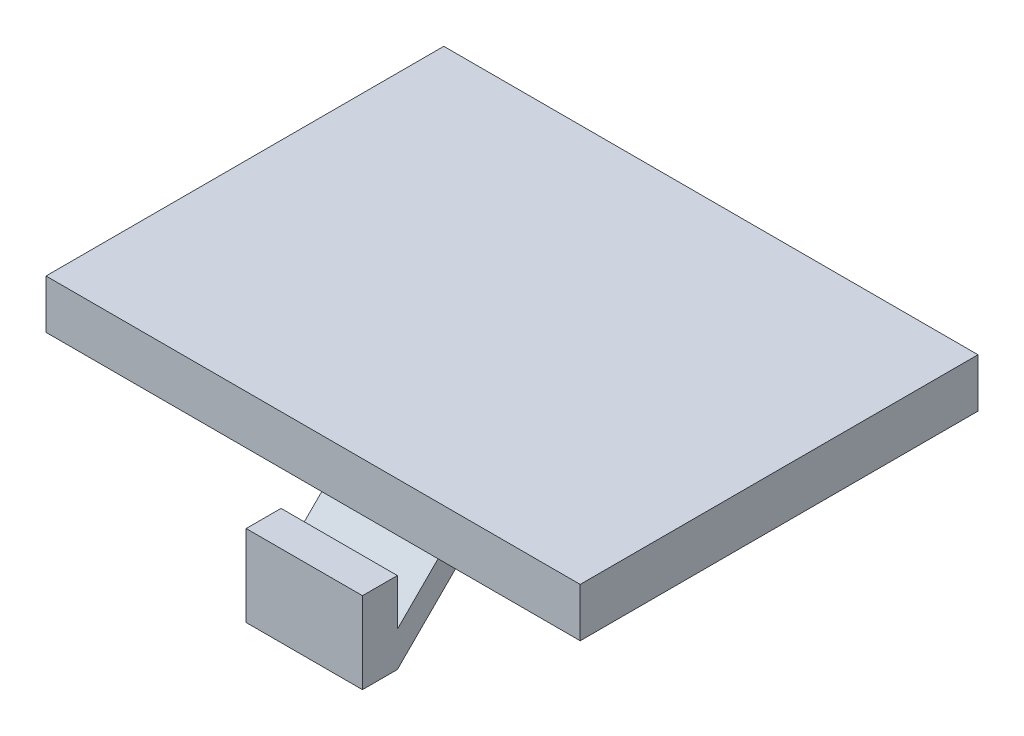
ISO-10303-21;
HEADER;
FILE_DESCRIPTION(('STEP AP214'),'2;1');
FILE_NAME('part.step','',(''),(''),'','','');
FILE_SCHEMA(('AUTOMOTIVE_DESIGN { 1 0 10303 214 1 1 1 1 }'));
ENDSEC;
DATA;
#1=APPLICATION_CONTEXT('core data for automotive mechanical design processes');
#2=APPLICATION_PROTOCOL_DEFINITION('international standard','automotive_design',2000,#1);
#3=PRODUCT_CONTEXT('',#1,'mechanical');
#4=PRODUCT('Part','Part','',(#3));
#5=PRODUCT_RELATED_PRODUCT_CATEGORY('part','',(#4));
#6=PRODUCT_DEFINITION_FORMATION('','',#4);
#7=PRODUCT_DEFINITION_CONTEXT('part definition',#1,'design');
#8=PRODUCT_DEFINITION('design','',#6,#7);
#9=PRODUCT_DEFINITION_SHAPE('','',#8);
#10=(LENGTH_UNIT() NAMED_UNIT(*) SI_UNIT(.MILLI.,.METRE.));
#11=(NAMED_UNIT(*) PLANE_ANGLE_UNIT() SI_UNIT($,.RADIAN.));
#12=(NAMED_UNIT(*) SI_UNIT($,.STERADIAN.) SOLID_ANGLE_UNIT());
#13=UNCERTAINTY_MEASURE_WITH_UNIT(LENGTH_MEASURE(1.E-05),#10,'distance_accuracy_value','');
#14=(GEOMETRIC_REPRESENTATION_CONTEXT(3) GLOBAL_UNCERTAINTY_ASSIGNED_CONTEXT((#13)) GLOBAL_UNIT_ASSIGNED_CONTEXT((#10,
#11,#12)) REPRESENTATION_CONTEXT('',''));
#15=CARTESIAN_POINT('',(0.,0.,0.));
#16=DIRECTION('',(0.,0.,1.));
#17=DIRECTION('',(1.,0.,0.));
#18=AXIS2_PLACEMENT_3D('',#15,#16,#17);
#19=CARTESIAN_POINT('',(-89.5,-291557.1,18.100000000004));
#20=DIRECTION('',(0.,0.,1.));
#21=DIRECTION('',(1.,0.,0.));
#22=AXIS2_PLACEMENT_3D('',#19,#20,#21);
#23=PLANE('',#22);
#24=DIRECTION('',(-1.,0.,0.));
#25=VECTOR('',#24,1.);
#26=CARTESIAN_POINT('',(-89.5,-2.00000000000759,18.100000000004));
#27=LINE('',#26,#25);
#28=CARTESIAN_POINT('',(-89.5,-2.00000000000759,18.100000000004));
#29=VERTEX_POINT('',#28);
#30=CARTESIAN_POINT('',(-94.5,-2.00000000000759,18.100000000004));
#31=VERTEX_POINT('',#30);
#32=EDGE_CURVE('E47',#29,#31,#27,.T.);
#33=ORIENTED_EDGE('',*,*,#32,.T.);
#34=DIRECTION('',(0.,1.,0.));
#35=VECTOR('',#34,1.);
#36=CARTESIAN_POINT('',(-94.5,-291557.1,18.100000000004));
#37=LINE('',#36,#35);
#38=CARTESIAN_POINT('',(-94.5,-5.49999999998363,18.100000000004));
#39=VERTEX_POINT('',#38);
#40=EDGE_CURVE('E102',#39,#31,#37,.T.);
#41=ORIENTED_EDGE('',*,*,#40,.F.);
#42=DIRECTION('',(-1.,0.,0.));
#43=VECTOR('',#42,1.);
#44=CARTESIAN_POINT('',(-89.5,-5.49999999998363,18.100000000004));
#45=LINE('',#44,#43);
#46=CARTESIAN_POINT('',(-89.5,-5.49999999998363,18.100000000004));
#47=VERTEX_POINT('',#46);
#48=EDGE_CURVE('E12',#47,#39,#45,.T.);
#49=ORIENTED_EDGE('',*,*,#48,.F.);
#50=DIRECTION('',(0.,1.,0.));
#51=VECTOR('',#50,1.);
#52=CARTESIAN_POINT('',(-89.5,-291557.1,18.100000000004));
#53=LINE('',#52,#51);
#54=EDGE_CURVE('E103',#47,#29,#53,.T.);
#55=ORIENTED_EDGE('',*,*,#54,.T.);
#56=EDGE_LOOP('',(#33,#41,#49,#55));
#57=FACE_BOUND('',#56,.T.);
#58=ADVANCED_FACE('F44',(#57),#23,.T.);
#59=CARTESIAN_POINT('',(-89.5,-5.49999999998363,-399991.45));
#60=DIRECTION('',(0.,-1.,0.));
#61=DIRECTION('',(0.,0.,-1.));
#62=AXIS2_PLACEMENT_3D('',#59,#60,#61);
#63=PLANE('',#62);
#64=ORIENTED_EDGE('',*,*,#48,.T.);
#65=DIRECTION('',(0.,0.,1.));
#66=VECTOR('',#65,1.);
#67=CARTESIAN_POINT('',(-94.5,-5.49999999998363,-399991.45));
#68=LINE('',#67,#66);
#69=CARTESIAN_POINT('',(-94.5,-5.49999999998363,16.6000000000395));
#70=VERTEX_POINT('',#69);
#71=EDGE_CURVE('E120',#70,#39,#68,.T.);
#72=ORIENTED_EDGE('',*,*,#71,.F.);
#73=DIRECTION('',(-1.,0.,0.));
#74=VECTOR('',#73,1.);
#75=CARTESIAN_POINT('',(-89.5,-5.49999999998363,16.6000000000395));
#76=LINE('',#75,#74);
#77=CARTESIAN_POINT('',(-89.5,-5.49999999998363,16.6000000000395));
#78=VERTEX_POINT('',#77);
#79=EDGE_CURVE('E52',#78,#70,#76,.T.);
#80=ORIENTED_EDGE('',*,*,#79,.F.);
#81=DIRECTION('',(0.,0.,1.));
#82=VECTOR('',#81,1.);
#83=CARTESIAN_POINT('',(-89.5,-5.49999999998363,-399991.45));
#84=LINE('',#83,#82);
#85=EDGE_CURVE('E108',#78,#47,#84,.T.);
#86=ORIENTED_EDGE('',*,*,#85,.T.);
#87=EDGE_LOOP('',(#64,#72,#80,#86));
#88=FACE_BOUND('',#87,.T.);
#89=ADVANCED_FACE('F172',(#88),#63,.T.);
#90=CARTESIAN_POINT('',(-89.5,54222.725,-54211.6249999999));
#91=DIRECTION('',(0.,-0.707106781186547,-0.707106781186548));
#92=DIRECTION('',(0.,0.707106781186548,-0.707106781186547));
#93=AXIS2_PLACEMENT_3D('',#90,#91,#92);
#94=PLANE('',#93);
#95=ORIENTED_EDGE('',*,*,#79,.T.);
#96=DIRECTION('',(0.,-0.707106781186548,0.707106781186547));
#97=VECTOR('',#96,1.);
#98=CARTESIAN_POINT('',(-94.5,54222.725,-54211.6249999999));
#99=LINE('',#98,#97);
#100=CARTESIAN_POINT('',(-94.5,5.6843418860808E-11,11.1000000000345));
#101=VERTEX_POINT('',#100);
#102=EDGE_CURVE('E130',#101,#70,#99,.T.);
#103=ORIENTED_EDGE('',*,*,#102,.F.);
#104=DIRECTION('',(-1.,0.,0.));
#105=VECTOR('',#104,1.);
#106=CARTESIAN_POINT('',(-89.5,5.6843418860808E-11,11.1000000000345));
#107=LINE('',#106,#105);
#108=CARTESIAN_POINT('',(-89.5,5.6843418860808E-11,11.1000000000345));
#109=VERTEX_POINT('',#108);
#110=EDGE_CURVE('E149',#109,#101,#107,.T.);
#111=ORIENTED_EDGE('',*,*,#110,.F.);
#112=DIRECTION('',(0.,-0.707106781186548,0.707106781186547));
#113=VECTOR('',#112,1.);
#114=CARTESIAN_POINT('',(-89.5,54222.725,-54211.6249999999));
#115=LINE('',#114,#113);
#116=EDGE_CURVE('E145',#109,#78,#115,.T.);
#117=ORIENTED_EDGE('',*,*,#116,.T.);
#118=EDGE_LOOP('',(#95,#103,#111,#117));
#119=FACE_BOUND('',#118,.T.);
#120=ADVANCED_FACE('F170',(#119),#94,.T.);
#121=CARTESIAN_POINT('',(-89.5,-5.6843418860808E-11,-399991.45));
#122=DIRECTION('',(0.,1.,0.));
#123=DIRECTION('',(0.,0.,1.));
#124=AXIS2_PLACEMENT_3D('',#121,#122,#123);
#125=PLANE('',#124);
#126=ORIENTED_EDGE('',*,*,#110,.T.);
#127=DIRECTION('',(0.,0.,-1.));
#128=VECTOR('',#127,1.);
#129=CARTESIAN_POINT('',(-94.5,-5.6843418860808E-11,-399991.45));
#130=LINE('',#129,#128);
#131=CARTESIAN_POINT('',(-94.5,2.48005277189382E-11,12.6000000001341));
#132=VERTEX_POINT('',#131);
#133=EDGE_CURVE('E127',#132,#101,#130,.T.);
#134=ORIENTED_EDGE('',*,*,#133,.F.);
#135=DIRECTION('',(-1.,0.,0.));
#136=VECTOR('',#135,1.);
#137=CARTESIAN_POINT('',(-89.5,2.48005277189382E-11,12.6000000001341));
#138=LINE('',#137,#136);
#139=CARTESIAN_POINT('',(-89.5,2.48005277189382E-11,12.6000000001341));
#140=VERTEX_POINT('',#139);
#141=EDGE_CURVE('E151',#140,#132,#138,.T.);
#142=ORIENTED_EDGE('',*,*,#141,.F.);
#143=DIRECTION('',(0.,0.,-1.));
#144=VECTOR('',#143,1.);
#145=CARTESIAN_POINT('',(-89.5,-5.6843418860808E-11,-399991.45));
#146=LINE('',#145,#144);
#147=EDGE_CURVE('E142',#140,#109,#146,.T.);
#148=ORIENTED_EDGE('',*,*,#147,.T.);
#149=EDGE_LOOP('',(#126,#134,#142,#148));
#150=FACE_BOUND('',#149,.T.);
#151=ADVANCED_FACE('F164',(#150),#125,.T.);
#152=CARTESIAN_POINT('',(-89.5,54223.475,-54210.8749999999));
#153=DIRECTION('',(0.,0.707106781186547,0.707106781186548));
#154=DIRECTION('',(0.,-0.707106781186548,0.707106781186547));
#155=AXIS2_PLACEMENT_3D('',#152,#153,#154);
#156=PLANE('',#155);
#157=ORIENTED_EDGE('',*,*,#141,.T.);
#158=DIRECTION('',(0.,0.707106781186548,-0.707106781186547));
#159=VECTOR('',#158,1.);
#160=CARTESIAN_POINT('',(-94.5,54223.475,-54210.8749999999));
#161=LINE('',#160,#159);
#162=CARTESIAN_POINT('',(-94.5,-3.99999999994094,16.6000000000679));
#163=VERTEX_POINT('',#162);
#164=EDGE_CURVE('E124',#163,#132,#161,.T.);
#165=ORIENTED_EDGE('',*,*,#164,.F.);
#166=DIRECTION('',(-1.,0.,0.));
#167=VECTOR('',#166,1.);
#168=CARTESIAN_POINT('',(-89.5,-3.99999999994094,16.6000000000679));
#169=LINE('',#168,#167);
#170=CARTESIAN_POINT('',(-89.5,-3.99999999994094,16.6000000000679));
#171=VERTEX_POINT('',#170);
#172=EDGE_CURVE('E153',#171,#163,#169,.T.);
#173=ORIENTED_EDGE('',*,*,#172,.F.);
#174=DIRECTION('',(0.,0.707106781186548,-0.707106781186547));
#175=VECTOR('',#174,1.);
#176=CARTESIAN_POINT('',(-89.5,54223.475,-54210.8749999999));
#177=LINE('',#176,#175);
#178=EDGE_CURVE('E139',#171,#140,#177,.T.);
#179=ORIENTED_EDGE('',*,*,#178,.T.);
#180=EDGE_LOOP('',(#157,#165,#173,#179));
#181=FACE_BOUND('',#180,.T.);
#182=ADVANCED_FACE('F161',(#181),#156,.T.);
#183=CARTESIAN_POINT('',(-89.5,-291557.1,16.5999999999826));
#184=DIRECTION('',(0.,0.,-1.));
#185=DIRECTION('',(-1.,0.,0.));
#186=AXIS2_PLACEMENT_3D('',#183,#184,#185);
#187=PLANE('',#186);
#188=ORIENTED_EDGE('',*,*,#172,.T.);
#189=DIRECTION('',(0.,-1.,0.));
#190=VECTOR('',#189,1.);
#191=CARTESIAN_POINT('',(-94.5,-291557.1,16.5999999999826));
#192=LINE('',#191,#190);
#193=CARTESIAN_POINT('',(-94.5,-2.00000000000955,16.5999999999826));
#194=VERTEX_POINT('',#193);
#195=EDGE_CURVE('E115',#194,#163,#192,.T.);
#196=ORIENTED_EDGE('',*,*,#195,.F.);
#197=DIRECTION('',(-1.,0.,0.));
#198=VECTOR('',#197,1.);
#199=CARTESIAN_POINT('',(-89.5,-2.00000000000955,16.5999999999826));
#200=LINE('',#199,#198);
#201=CARTESIAN_POINT('',(-89.5,-2.00000000000955,16.5999999999826));
#202=VERTEX_POINT('',#201);
#203=EDGE_CURVE('E107',#202,#194,#200,.T.);
#204=ORIENTED_EDGE('',*,*,#203,.F.);
#205=DIRECTION('',(0.,-1.,0.));
#206=VECTOR('',#205,1.);
#207=CARTESIAN_POINT('',(-89.5,-291557.1,16.5999999999826));
#208=LINE('',#207,#206);
#209=EDGE_CURVE('E136',#202,#171,#208,.T.);
#210=ORIENTED_EDGE('',*,*,#209,.T.);
#211=EDGE_LOOP('',(#188,#196,#204,#210));
#212=FACE_BOUND('',#211,.T.);
#213=ADVANCED_FACE('F155',(#212),#187,.T.);
#214=CARTESIAN_POINT('',(-89.5,-2.00000000012324,-399991.45));
#215=DIRECTION('',(0.,1.,0.));
#216=DIRECTION('',(0.,0.,1.));
#217=AXIS2_PLACEMENT_3D('',#214,#215,#216);
#218=PLANE('',#217);
#219=ORIENTED_EDGE('',*,*,#203,.T.);
#220=DIRECTION('',(0.,0.,-1.));
#221=VECTOR('',#220,1.);
#222=CARTESIAN_POINT('',(-94.5,-2.00000000012324,-399991.45));
#223=LINE('',#222,#221);
#224=EDGE_CURVE('E110',#31,#194,#223,.T.);
#225=ORIENTED_EDGE('',*,*,#224,.F.);
#226=ORIENTED_EDGE('',*,*,#32,.F.);
#227=DIRECTION('',(0.,0.,-1.));
#228=VECTOR('',#227,1.);
#229=CARTESIAN_POINT('',(-89.5,-2.00000000012324,-399991.45));
#230=LINE('',#229,#228);
#231=EDGE_CURVE('E134',#29,#202,#230,.T.);
#232=ORIENTED_EDGE('',*,*,#231,.T.);
#233=EDGE_LOOP('',(#219,#225,#226,#232));
#234=FACE_BOUND('',#233,.T.);
#235=ADVANCED_FACE('F111',(#234),#218,.T.);
#236=CARTESIAN_POINT('',(-89.5,0.,0.));
#237=DIRECTION('',(-1.,0.,0.));
#238=DIRECTION('',(0.,0.,1.));
#239=AXIS2_PLACEMENT_3D('',#236,#237,#238);
#240=PLANE('',#239);
#241=ORIENTED_EDGE('',*,*,#54,.F.);
#242=ORIENTED_EDGE('',*,*,#85,.F.);
#243=ORIENTED_EDGE('',*,*,#116,.F.);
#244=ORIENTED_EDGE('',*,*,#147,.F.);
#245=ORIENTED_EDGE('',*,*,#178,.F.);
#246=ORIENTED_EDGE('',*,*,#209,.F.);
#247=ORIENTED_EDGE('',*,*,#231,.F.);
#248=EDGE_LOOP('',(#241,#242,#243,#244,#245,#246,#247));
#249=FACE_BOUND('',#248,.T.);
#250=ADVANCED_FACE('F167',(#249),#240,.F.);
#251=CARTESIAN_POINT('',(-94.5,0.,0.));
#252=DIRECTION('',(-1.,0.,0.));
#253=DIRECTION('',(0.,0.,1.));
#254=AXIS2_PLACEMENT_3D('',#251,#252,#253);
#255=PLANE('',#254);
#256=ORIENTED_EDGE('',*,*,#40,.T.);
#257=ORIENTED_EDGE('',*,*,#224,.T.);
#258=ORIENTED_EDGE('',*,*,#195,.T.);
#259=ORIENTED_EDGE('',*,*,#164,.T.);
#260=ORIENTED_EDGE('',*,*,#133,.T.);
#261=ORIENTED_EDGE('',*,*,#102,.T.);
#262=ORIENTED_EDGE('',*,*,#71,.T.);
#263=EDGE_LOOP('',(#256,#257,#258,#259,#260,#261,#262));
#264=FACE_BOUND('',#263,.T.);
#265=ADVANCED_FACE('F118',(#264),#255,.T.);
#266=CLOSED_SHELL('',(#58,#89,#120,#151,#182,#213,#235,#250,#265));
#267=MANIFOLD_SOLID_BREP('B2',#266);
#268=CARTESIAN_POINT('',(0.,0.,17.1));
#269=DIRECTION('',(0.,1.,0.));
#270=DIRECTION('',(-1.,0.,0.));
#271=AXIS2_PLACEMENT_3D('',#268,#269,#270);
#272=PLANE('',#271);
#273=DIRECTION('',(0.,0.,1.));
#274=VECTOR('',#273,1.);
#275=CARTESIAN_POINT('',(-104.103810704409,0.,17.1));
#276=LINE('',#275,#274);
#277=CARTESIAN_POINT('',(-104.103810704409,0.,0.));
#278=VERTEX_POINT('',#277);
#279=CARTESIAN_POINT('',(-104.103810704409,0.,17.1));
#280=VERTEX_POINT('',#279);
#281=EDGE_CURVE('E260',#278,#280,#276,.T.);
#282=ORIENTED_EDGE('',*,*,#281,.F.);
#283=DIRECTION('',(1.,0.,0.));
#284=VECTOR('',#283,1.);
#285=CARTESIAN_POINT('',(0.,0.,0.));
#286=LINE('',#285,#284);
#287=CARTESIAN_POINT('',(-81.1401188553731,0.,0.));
#288=VERTEX_POINT('',#287);
#289=EDGE_CURVE('E298',#278,#288,#286,.T.);
#290=ORIENTED_EDGE('',*,*,#289,.T.);
#291=DIRECTION('',(0.,0.,-1.));
#292=VECTOR('',#291,1.);
#293=CARTESIAN_POINT('',(-81.1401188553731,0.,17.1));
#294=LINE('',#293,#292);
#295=CARTESIAN_POINT('',(-81.1401188553731,0.,17.1));
#296=VERTEX_POINT('',#295);
#297=EDGE_CURVE('E305',#296,#288,#294,.T.);
#298=ORIENTED_EDGE('',*,*,#297,.F.);
#299=DIRECTION('',(1.,0.,0.));
#300=VECTOR('',#299,1.);
#301=CARTESIAN_POINT('',(0.,0.,17.1));
#302=LINE('',#301,#300);
#303=EDGE_CURVE('E311',#280,#296,#302,.T.);
#304=ORIENTED_EDGE('',*,*,#303,.F.);
#305=EDGE_LOOP('',(#282,#290,#298,#304));
#306=FACE_BOUND('',#305,.T.);
#307=ADVANCED_FACE('F246',(#306),#272,.F.);
#308=CARTESIAN_POINT('',(0.,0.,17.1));
#309=DIRECTION('',(0.,0.,1.));
#310=DIRECTION('',(1.,0.,0.));
#311=AXIS2_PLACEMENT_3D('',#308,#309,#310);
#312=PLANE('',#311);
#313=DIRECTION('',(1.,0.,0.));
#314=VECTOR('',#313,1.);
#315=CARTESIAN_POINT('',(-181.9,2.09999999999998,17.1));
#316=LINE('',#315,#314);
#317=CARTESIAN_POINT('',(-104.103810704409,2.09999999999999,17.1));
#318=VERTEX_POINT('',#317);
#319=CARTESIAN_POINT('',(-81.1401188553731,2.09999999999999,17.1));
#320=VERTEX_POINT('',#319);
#321=EDGE_CURVE('E309',#318,#320,#316,.T.);
#322=ORIENTED_EDGE('',*,*,#321,.F.);
#323=DIRECTION('',(0.,-1.,0.));
#324=VECTOR('',#323,1.);
#325=CARTESIAN_POINT('',(-104.103810704409,0.,17.1));
#326=LINE('',#325,#324);
#327=EDGE_CURVE('E263',#318,#280,#326,.T.);
#328=ORIENTED_EDGE('',*,*,#327,.T.);
#329=ORIENTED_EDGE('',*,*,#303,.T.);
#330=DIRECTION('',(0.,1.,0.));
#331=VECTOR('',#330,1.);
#332=CARTESIAN_POINT('',(-81.1401188553731,0.,17.1));
#333=LINE('',#332,#331);
#334=EDGE_CURVE('E302',#296,#320,#333,.T.);
#335=ORIENTED_EDGE('',*,*,#334,.T.);
#336=EDGE_LOOP('',(#322,#328,#329,#335));
#337=FACE_BOUND('',#336,.T.);
#338=ADVANCED_FACE('F318',(#337),#312,.T.);
#339=CARTESIAN_POINT('',(0.,0.,0.));
#340=DIRECTION('',(0.,0.,1.));
#341=DIRECTION('',(1.,0.,0.));
#342=AXIS2_PLACEMENT_3D('',#339,#340,#341);
#343=PLANE('',#342);
#344=DIRECTION('',(0.,1.,0.));
#345=VECTOR('',#344,1.);
#346=CARTESIAN_POINT('',(-104.103810704409,2.09999999999999,0.));
#347=LINE('',#346,#345);
#348=CARTESIAN_POINT('',(-104.103810704409,2.09999999999999,0.));
#349=VERTEX_POINT('',#348);
#350=EDGE_CURVE('E283',#278,#349,#347,.T.);
#351=ORIENTED_EDGE('',*,*,#350,.T.);
#352=DIRECTION('',(1.,0.,0.));
#353=VECTOR('',#352,1.);
#354=CARTESIAN_POINT('',(-104.103810704409,2.09999999999999,0.));
#355=LINE('',#354,#353);
#356=CARTESIAN_POINT('',(-81.1401188553731,2.09999999999999,0.));
#357=VERTEX_POINT('',#356);
#358=EDGE_CURVE('E288',#349,#357,#355,.T.);
#359=ORIENTED_EDGE('',*,*,#358,.T.);
#360=DIRECTION('',(0.,-1.,0.));
#361=VECTOR('',#360,1.);
#362=CARTESIAN_POINT('',(-81.1401188553731,2.09999999999999,0.));
#363=LINE('',#362,#361);
#364=EDGE_CURVE('E293',#357,#288,#363,.T.);
#365=ORIENTED_EDGE('',*,*,#364,.T.);
#366=ORIENTED_EDGE('',*,*,#289,.F.);
#367=EDGE_LOOP('',(#351,#359,#365,#366));
#368=FACE_BOUND('',#367,.T.);
#369=ADVANCED_FACE('F296',(#368),#343,.F.);
#370=CARTESIAN_POINT('',(-181.9,2.09999999999998,12.1));
#371=DIRECTION('',(0.,-1.,0.));
#372=DIRECTION('',(1.,0.,0.));
#373=AXIS2_PLACEMENT_3D('',#370,#371,#372);
#374=PLANE('',#373);
#375=DIRECTION('',(0.,0.,-1.));
#376=VECTOR('',#375,1.);
#377=CARTESIAN_POINT('',(-104.103810704409,2.09999999999999,12.1));
#378=LINE('',#377,#376);
#379=EDGE_CURVE('E42',#318,#349,#378,.T.);
#380=ORIENTED_EDGE('',*,*,#379,.F.);
#381=ORIENTED_EDGE('',*,*,#321,.T.);
#382=DIRECTION('',(0.,0.,1.));
#383=VECTOR('',#382,1.);
#384=CARTESIAN_POINT('',(-81.1401188553731,2.09999999999999,12.1));
#385=LINE('',#384,#383);
#386=EDGE_CURVE('E253',#357,#320,#385,.T.);
#387=ORIENTED_EDGE('',*,*,#386,.F.);
#388=ORIENTED_EDGE('',*,*,#358,.F.);
#389=EDGE_LOOP('',(#380,#381,#387,#388));
#390=FACE_BOUND('',#389,.T.);
#391=ADVANCED_FACE('F289',(#390),#374,.F.);
#392=CARTESIAN_POINT('',(-104.103810704409,2.09999999999999,27.1));
#393=DIRECTION('',(-1.,0.,0.));
#394=DIRECTION('',(0.,0.,1.));
#395=AXIS2_PLACEMENT_3D('',#392,#393,#394);
#396=PLANE('',#395);
#397=ORIENTED_EDGE('',*,*,#281,.T.);
#398=ORIENTED_EDGE('',*,*,#327,.F.);
#399=ORIENTED_EDGE('',*,*,#379,.T.);
#400=ORIENTED_EDGE('',*,*,#350,.F.);
#401=EDGE_LOOP('',(#397,#398,#399,#400));
#402=FACE_BOUND('',#401,.T.);
#403=ADVANCED_FACE('F281',(#402),#396,.T.);
#404=CARTESIAN_POINT('',(-81.1401188553731,2.09999999999999,27.1));
#405=DIRECTION('',(1.,0.,0.));
#406=DIRECTION('',(0.,0.,-1.));
#407=AXIS2_PLACEMENT_3D('',#404,#405,#406);
#408=PLANE('',#407);
#409=ORIENTED_EDGE('',*,*,#297,.T.);
#410=ORIENTED_EDGE('',*,*,#364,.F.);
#411=ORIENTED_EDGE('',*,*,#386,.T.);
#412=ORIENTED_EDGE('',*,*,#334,.F.);
#413=EDGE_LOOP('',(#409,#410,#411,#412));
#414=FACE_BOUND('',#413,.T.);
#415=ADVANCED_FACE('F315',(#414),#408,.T.);
#416=CLOSED_SHELL('',(#307,#338,#369,#391,#403,#415));
#417=MANIFOLD_SOLID_BREP('B6',#416);
#418=ADVANCED_BREP_SHAPE_REPRESENTATION('',(#18,#267,#417),#14);
#419=SHAPE_DEFINITION_REPRESENTATION(#9,#418);
ENDSEC;
END-ISO-10303-21;
